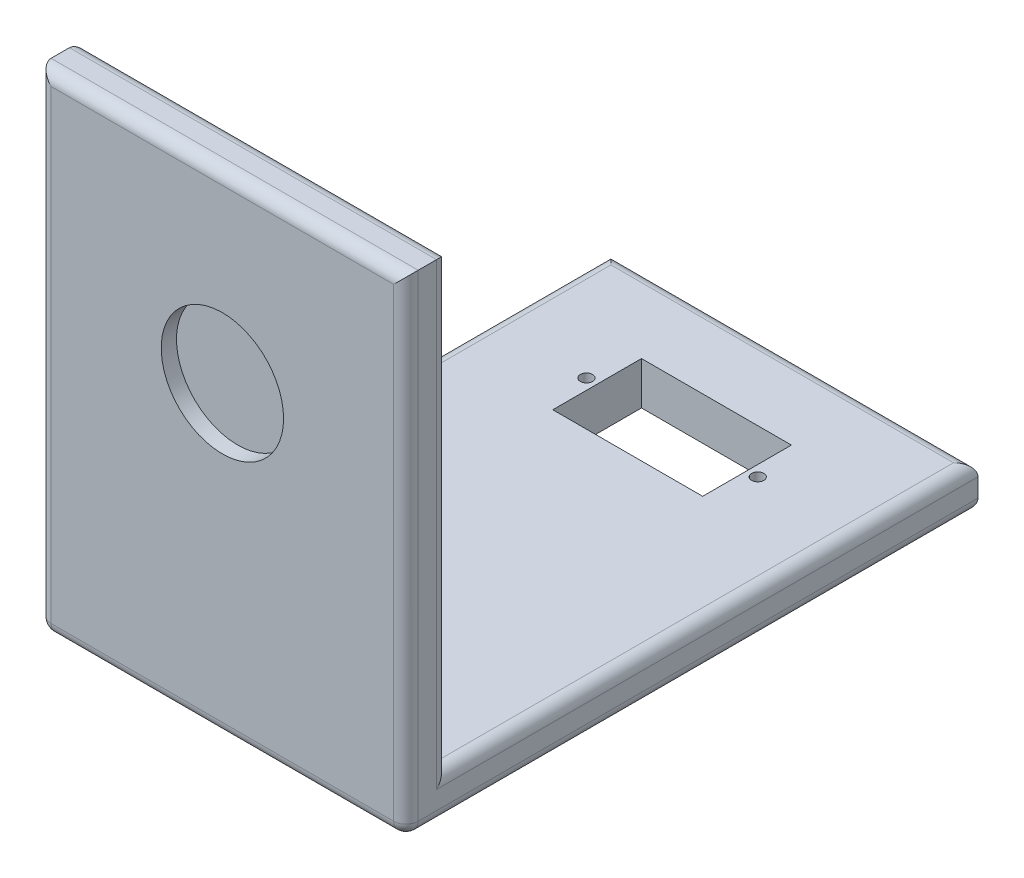
ISO-10303-21;
HEADER;
FILE_DESCRIPTION(('STEP AP214'),'2;1');
FILE_NAME('part.step','',(''),(''),'','','');
FILE_SCHEMA(('AUTOMOTIVE_DESIGN { 1 0 10303 214 1 1 1 1 }'));
ENDSEC;
DATA;
#1=APPLICATION_CONTEXT('core data for automotive mechanical design processes');
#2=APPLICATION_PROTOCOL_DEFINITION('international standard','automotive_design',2000,#1);
#3=PRODUCT_CONTEXT('',#1,'mechanical');
#4=PRODUCT('Part','Part','',(#3));
#5=PRODUCT_RELATED_PRODUCT_CATEGORY('part','',(#4));
#6=PRODUCT_DEFINITION_FORMATION('','',#4);
#7=PRODUCT_DEFINITION_CONTEXT('part definition',#1,'design');
#8=PRODUCT_DEFINITION('design','',#6,#7);
#9=PRODUCT_DEFINITION_SHAPE('','',#8);
#10=(LENGTH_UNIT() NAMED_UNIT(*) SI_UNIT(.MILLI.,.METRE.));
#11=(NAMED_UNIT(*) PLANE_ANGLE_UNIT() SI_UNIT($,.RADIAN.));
#12=(NAMED_UNIT(*) SI_UNIT($,.STERADIAN.) SOLID_ANGLE_UNIT());
#13=UNCERTAINTY_MEASURE_WITH_UNIT(LENGTH_MEASURE(1.E-05),#10,'distance_accuracy_value','');
#14=(GEOMETRIC_REPRESENTATION_CONTEXT(3) GLOBAL_UNCERTAINTY_ASSIGNED_CONTEXT((#13)) GLOBAL_UNIT_ASSIGNED_CONTEXT((#10,
#11,#12)) REPRESENTATION_CONTEXT('',''));
#15=CARTESIAN_POINT('',(0.,0.,0.));
#16=DIRECTION('',(0.,0.,1.));
#17=DIRECTION('',(1.,0.,0.));
#18=AXIS2_PLACEMENT_3D('',#15,#16,#17);
#19=CARTESIAN_POINT('',(30.,-3.5,45.));
#20=DIRECTION('',(1.,0.,0.));
#21=DIRECTION('',(0.,0.,-1.));
#22=AXIS2_PLACEMENT_3D('',#19,#20,#21);
#23=PLANE('',#22);
#24=DIRECTION('',(0.,0.,1.));
#25=VECTOR('',#24,1.);
#26=CARTESIAN_POINT('',(30.,76.5,41.5));
#27=LINE('',#26,#25);
#28=CARTESIAN_POINT('',(30.,76.5,43.5));
#29=VERTEX_POINT('',#28);
#30=CARTESIAN_POINT('',(30.,76.5,46.5));
#31=VERTEX_POINT('',#30);
#32=EDGE_CURVE('E281',#29,#31,#27,.T.);
#33=ORIENTED_EDGE('',*,*,#32,.T.);
#34=DIRECTION('',(0.,1.,0.));
#35=VECTOR('',#34,1.);
#36=CARTESIAN_POINT('',(30.,-3.5,46.5));
#37=LINE('',#36,#35);
#38=CARTESIAN_POINT('',(30.,-1.5,46.5));
#39=VERTEX_POINT('',#38);
#40=EDGE_CURVE('E222',#31,#39,#37,.F.);
#41=ORIENTED_EDGE('',*,*,#40,.T.);
#42=DIRECTION('',(0.,0.,-1.));
#43=VECTOR('',#42,1.);
#44=CARTESIAN_POINT('',(30.,-1.5,45.));
#45=LINE('',#44,#43);
#46=CARTESIAN_POINT('',(30.,-1.5,-45.));
#47=VERTEX_POINT('',#46);
#48=EDGE_CURVE('E220',#39,#47,#45,.T.);
#49=ORIENTED_EDGE('',*,*,#48,.T.);
#50=DIRECTION('',(0.,1.,0.));
#51=VECTOR('',#50,1.);
#52=CARTESIAN_POINT('',(30.,-3.5,-45.));
#53=LINE('',#52,#51);
#54=CARTESIAN_POINT('',(30.,1.5,-45.));
#55=VERTEX_POINT('',#54);
#56=EDGE_CURVE('E164',#47,#55,#53,.T.);
#57=ORIENTED_EDGE('',*,*,#56,.T.);
#58=DIRECTION('',(0.,0.,-1.));
#59=VECTOR('',#58,1.);
#60=CARTESIAN_POINT('',(30.,1.5,41.5));
#61=LINE('',#60,#59);
#62=CARTESIAN_POINT('',(30.,1.5,43.5));
#63=VERTEX_POINT('',#62);
#64=EDGE_CURVE('E216',#55,#63,#61,.F.);
#65=ORIENTED_EDGE('',*,*,#64,.T.);
#66=DIRECTION('',(0.,1.,0.));
#67=VECTOR('',#66,1.);
#68=CARTESIAN_POINT('',(30.,-3.5,43.5));
#69=LINE('',#68,#67);
#70=EDGE_CURVE('E218',#63,#29,#69,.T.);
#71=ORIENTED_EDGE('',*,*,#70,.T.);
#72=EDGE_LOOP('',(#33,#41,#49,#57,#65,#71));
#73=FACE_BOUND('',#72,.T.);
#74=ADVANCED_FACE('F33',(#73),#23,.T.);
#75=CARTESIAN_POINT('',(-30.,-3.5,45.));
#76=DIRECTION('',(-1.,0.,0.));
#77=DIRECTION('',(0.,0.,1.));
#78=AXIS2_PLACEMENT_3D('',#75,#76,#77);
#79=PLANE('',#78);
#80=DIRECTION('',(0.,0.,1.));
#81=VECTOR('',#80,1.);
#82=CARTESIAN_POINT('',(-30.,-1.5,45.));
#83=LINE('',#82,#81);
#84=CARTESIAN_POINT('',(-30.,-1.5,-45.));
#85=VERTEX_POINT('',#84);
#86=CARTESIAN_POINT('',(-30.,-1.5,46.5));
#87=VERTEX_POINT('',#86);
#88=EDGE_CURVE('E238',#85,#87,#83,.T.);
#89=ORIENTED_EDGE('',*,*,#88,.T.);
#90=DIRECTION('',(0.,-1.,0.));
#91=VECTOR('',#90,1.);
#92=CARTESIAN_POINT('',(-30.,76.5,46.5));
#93=LINE('',#92,#91);
#94=CARTESIAN_POINT('',(-30.,76.5,46.5));
#95=VERTEX_POINT('',#94);
#96=EDGE_CURVE('E240',#87,#95,#93,.F.);
#97=ORIENTED_EDGE('',*,*,#96,.T.);
#98=DIRECTION('',(0.,0.,1.));
#99=VECTOR('',#98,1.);
#100=CARTESIAN_POINT('',(-30.,76.5,41.5));
#101=LINE('',#100,#99);
#102=CARTESIAN_POINT('',(-30.,76.5,43.5));
#103=VERTEX_POINT('',#102);
#104=EDGE_CURVE('E329',#103,#95,#101,.T.);
#105=ORIENTED_EDGE('',*,*,#104,.F.);
#106=DIRECTION('',(0.,-1.,0.));
#107=VECTOR('',#106,1.);
#108=CARTESIAN_POINT('',(-30.,-3.5,43.5));
#109=LINE('',#108,#107);
#110=CARTESIAN_POINT('',(-30.,1.5,43.5));
#111=VERTEX_POINT('',#110);
#112=EDGE_CURVE('E235',#103,#111,#109,.T.);
#113=ORIENTED_EDGE('',*,*,#112,.T.);
#114=DIRECTION('',(0.,0.,1.));
#115=VECTOR('',#114,1.);
#116=CARTESIAN_POINT('',(-30.,1.5,-45.));
#117=LINE('',#116,#115);
#118=CARTESIAN_POINT('',(-30.,1.5,-45.));
#119=VERTEX_POINT('',#118);
#120=EDGE_CURVE('E233',#111,#119,#117,.F.);
#121=ORIENTED_EDGE('',*,*,#120,.T.);
#122=DIRECTION('',(0.,1.,0.));
#123=VECTOR('',#122,1.);
#124=CARTESIAN_POINT('',(-30.,-3.5,-45.));
#125=LINE('',#124,#123);
#126=EDGE_CURVE('E195',#85,#119,#125,.T.);
#127=ORIENTED_EDGE('',*,*,#126,.F.);
#128=EDGE_LOOP('',(#89,#97,#105,#113,#121,#127));
#129=FACE_BOUND('',#128,.T.);
#130=ADVANCED_FACE('F333',(#129),#79,.T.);
#131=CARTESIAN_POINT('',(-30.,-3.5,-45.));
#132=DIRECTION('',(0.,0.,-1.));
#133=DIRECTION('',(-1.,0.,0.));
#134=AXIS2_PLACEMENT_3D('',#131,#132,#133);
#135=PLANE('',#134);
#136=ORIENTED_EDGE('',*,*,#56,.F.);
#137=DIRECTION('',(-1.,0.,0.));
#138=VECTOR('',#137,1.);
#139=CARTESIAN_POINT('',(-30.,-1.5,-45.));
#140=LINE('',#139,#138);
#141=EDGE_CURVE('E11',#47,#85,#140,.T.);
#142=ORIENTED_EDGE('',*,*,#141,.T.);
#143=ORIENTED_EDGE('',*,*,#126,.T.);
#144=DIRECTION('',(-1.,0.,0.));
#145=VECTOR('',#144,1.);
#146=CARTESIAN_POINT('',(30.,1.5,-45.));
#147=LINE('',#146,#145);
#148=EDGE_CURVE('E42',#119,#55,#147,.F.);
#149=ORIENTED_EDGE('',*,*,#148,.T.);
#150=EDGE_LOOP('',(#136,#142,#143,#149));
#151=FACE_BOUND('',#150,.T.);
#152=ADVANCED_FACE('F368',(#151),#135,.T.);
#153=CARTESIAN_POINT('',(0.,-3.5,0.));
#154=DIRECTION('',(0.,-1.,0.));
#155=DIRECTION('',(0.,0.,-1.));
#156=AXIS2_PLACEMENT_3D('',#153,#154,#155);
#157=PLANE('',#156);
#158=DIRECTION('',(0.,0.,-1.));
#159=VECTOR('',#158,1.);
#160=CARTESIAN_POINT('',(28.,-3.5,0.));
#161=LINE('',#160,#159);
#162=CARTESIAN_POINT('',(28.,-3.5,-43.));
#163=VERTEX_POINT('',#162);
#164=CARTESIAN_POINT('',(28.,-3.5,46.5));
#165=VERTEX_POINT('',#164);
#166=EDGE_CURVE('E228',#163,#165,#161,.F.);
#167=ORIENTED_EDGE('',*,*,#166,.T.);
#168=DIRECTION('',(1.,0.,0.));
#169=VECTOR('',#168,1.);
#170=CARTESIAN_POINT('',(-30.,-3.5,46.5));
#171=LINE('',#170,#169);
#172=CARTESIAN_POINT('',(-28.,-3.5,46.5));
#173=VERTEX_POINT('',#172);
#174=EDGE_CURVE('E230',#165,#173,#171,.F.);
#175=ORIENTED_EDGE('',*,*,#174,.T.);
#176=DIRECTION('',(0.,0.,1.));
#177=VECTOR('',#176,1.);
#178=CARTESIAN_POINT('',(-28.,-3.5,0.));
#179=LINE('',#178,#177);
#180=CARTESIAN_POINT('',(-28.,-3.5,-43.));
#181=VERTEX_POINT('',#180);
#182=EDGE_CURVE('E224',#173,#181,#179,.F.);
#183=ORIENTED_EDGE('',*,*,#182,.T.);
#184=DIRECTION('',(-1.,0.,0.));
#185=VECTOR('',#184,1.);
#186=CARTESIAN_POINT('',(0.,-3.5,-43.));
#187=LINE('',#186,#185);
#188=EDGE_CURVE('E226',#181,#163,#187,.F.);
#189=ORIENTED_EDGE('',*,*,#188,.T.);
#190=EDGE_LOOP('',(#167,#175,#183,#189));
#191=FACE_BOUND('',#190,.T.);
#192=CARTESIAN_POINT('',(14.,-3.5,-25.));
#193=DIRECTION('',(0.,-1.,0.));
#194=DIRECTION('',(0.,0.,-1.));
#195=AXIS2_PLACEMENT_3D('',#192,#193,#194);
#196=CIRCLE('',#195,1.);
#197=CARTESIAN_POINT('',(14.,-3.5,-26.));
#198=VERTEX_POINT('',#197);
#199=EDGE_CURVE('E335',#198,#198,#196,.F.);
#200=ORIENTED_EDGE('',*,*,#199,.T.);
#201=EDGE_LOOP('',(#200));
#202=FACE_BOUND('',#201,.T.);
#203=CARTESIAN_POINT('',(-14.,-3.5,-25.));
#204=DIRECTION('',(0.,-1.,0.));
#205=DIRECTION('',(0.,0.,-1.));
#206=AXIS2_PLACEMENT_3D('',#203,#204,#205);
#207=CIRCLE('',#206,1.);
#208=CARTESIAN_POINT('',(-14.,-3.5,-26.));
#209=VERTEX_POINT('',#208);
#210=EDGE_CURVE('E348',#209,#209,#207,.F.);
#211=ORIENTED_EDGE('',*,*,#210,.T.);
#212=EDGE_LOOP('',(#211));
#213=FACE_BOUND('',#212,.T.);
#214=DIRECTION('',(0.,0.,-1.));
#215=VECTOR('',#214,1.);
#216=CARTESIAN_POINT('',(12.25,-3.5,-17.75));
#217=LINE('',#216,#215);
#218=CARTESIAN_POINT('',(12.25,-3.5,-17.75));
#219=VERTEX_POINT('',#218);
#220=CARTESIAN_POINT('',(12.25,-3.5,-32.25));
#221=VERTEX_POINT('',#220);
#222=EDGE_CURVE('E169',#219,#221,#217,.T.);
#223=ORIENTED_EDGE('',*,*,#222,.T.);
#224=DIRECTION('',(-1.,0.,0.));
#225=VECTOR('',#224,1.);
#226=CARTESIAN_POINT('',(-12.25,-3.5,-32.25));
#227=LINE('',#226,#225);
#228=CARTESIAN_POINT('',(-12.25,-3.5,-32.25));
#229=VERTEX_POINT('',#228);
#230=EDGE_CURVE('E153',#221,#229,#227,.T.);
#231=ORIENTED_EDGE('',*,*,#230,.T.);
#232=DIRECTION('',(0.,0.,1.));
#233=VECTOR('',#232,1.);
#234=CARTESIAN_POINT('',(-12.25,-3.5,-17.75));
#235=LINE('',#234,#233);
#236=CARTESIAN_POINT('',(-12.25,-3.5,-17.75));
#237=VERTEX_POINT('',#236);
#238=EDGE_CURVE('E181',#229,#237,#235,.T.);
#239=ORIENTED_EDGE('',*,*,#238,.T.);
#240=DIRECTION('',(1.,0.,0.));
#241=VECTOR('',#240,1.);
#242=CARTESIAN_POINT('',(-12.25,-3.5,-17.75));
#243=LINE('',#242,#241);
#244=EDGE_CURVE('E177',#237,#219,#243,.T.);
#245=ORIENTED_EDGE('',*,*,#244,.T.);
#246=EDGE_LOOP('',(#223,#231,#239,#245));
#247=FACE_BOUND('',#246,.T.);
#248=ADVANCED_FACE('F176',(#191,#202,#213,#247),#157,.T.);
#249=CARTESIAN_POINT('',(0.,3.5,0.));
#250=DIRECTION('',(0.,-1.,0.));
#251=DIRECTION('',(0.,0.,-1.));
#252=AXIS2_PLACEMENT_3D('',#249,#250,#251);
#253=PLANE('',#252);
#254=CARTESIAN_POINT('',(14.,3.5,-25.));
#255=DIRECTION('',(0.,1.,0.));
#256=DIRECTION('',(0.,0.,-1.));
#257=AXIS2_PLACEMENT_3D('',#254,#255,#256);
#258=CIRCLE('',#257,1.);
#259=CARTESIAN_POINT('',(14.,3.5,-26.));
#260=VERTEX_POINT('',#259);
#261=EDGE_CURVE('E338',#260,#260,#258,.T.);
#262=ORIENTED_EDGE('',*,*,#261,.F.);
#263=EDGE_LOOP('',(#262));
#264=FACE_BOUND('',#263,.T.);
#265=CARTESIAN_POINT('',(-14.,3.5,-25.));
#266=DIRECTION('',(0.,1.,0.));
#267=DIRECTION('',(0.,0.,1.));
#268=AXIS2_PLACEMENT_3D('',#265,#266,#267);
#269=CIRCLE('',#268,1.);
#270=CARTESIAN_POINT('',(-14.,3.5,-24.));
#271=VERTEX_POINT('',#270);
#272=EDGE_CURVE('E345',#271,#271,#269,.T.);
#273=ORIENTED_EDGE('',*,*,#272,.F.);
#274=EDGE_LOOP('',(#273));
#275=FACE_BOUND('',#274,.T.);
#276=DIRECTION('',(-1.,0.,0.));
#277=VECTOR('',#276,1.);
#278=CARTESIAN_POINT('',(-12.25,3.5,-32.25));
#279=LINE('',#278,#277);
#280=CARTESIAN_POINT('',(12.25,3.5,-32.25));
#281=VERTEX_POINT('',#280);
#282=CARTESIAN_POINT('',(-12.25,3.5,-32.25));
#283=VERTEX_POINT('',#282);
#284=EDGE_CURVE('E179',#281,#283,#279,.T.);
#285=ORIENTED_EDGE('',*,*,#284,.F.);
#286=DIRECTION('',(0.,0.,-1.));
#287=VECTOR('',#286,1.);
#288=CARTESIAN_POINT('',(12.25,3.5,-17.75));
#289=LINE('',#288,#287);
#290=CARTESIAN_POINT('',(12.25,3.5,-17.75));
#291=VERTEX_POINT('',#290);
#292=EDGE_CURVE('E172',#291,#281,#289,.T.);
#293=ORIENTED_EDGE('',*,*,#292,.F.);
#294=DIRECTION('',(1.,0.,0.));
#295=VECTOR('',#294,1.);
#296=CARTESIAN_POINT('',(-12.25,3.5,-17.75));
#297=LINE('',#296,#295);
#298=CARTESIAN_POINT('',(-12.25,3.5,-17.75));
#299=VERTEX_POINT('',#298);
#300=EDGE_CURVE('E173',#299,#291,#297,.T.);
#301=ORIENTED_EDGE('',*,*,#300,.F.);
#302=DIRECTION('',(0.,0.,1.));
#303=VECTOR('',#302,1.);
#304=CARTESIAN_POINT('',(-12.25,3.5,-17.75));
#305=LINE('',#304,#303);
#306=EDGE_CURVE('E186',#283,#299,#305,.T.);
#307=ORIENTED_EDGE('',*,*,#306,.F.);
#308=EDGE_LOOP('',(#285,#293,#301,#307));
#309=FACE_BOUND('',#308,.T.);
#310=DIRECTION('',(1.,0.,0.));
#311=VECTOR('',#310,1.);
#312=CARTESIAN_POINT('',(0.,3.5,41.5));
#313=LINE('',#312,#311);
#314=CARTESIAN_POINT('',(-28.,3.5,41.5));
#315=VERTEX_POINT('',#314);
#316=CARTESIAN_POINT('',(28.,3.5,41.5));
#317=VERTEX_POINT('',#316);
#318=EDGE_CURVE('E198',#315,#317,#313,.T.);
#319=ORIENTED_EDGE('',*,*,#318,.T.);
#320=DIRECTION('',(0.,0.,-1.));
#321=VECTOR('',#320,1.);
#322=CARTESIAN_POINT('',(28.,3.5,-45.));
#323=LINE('',#322,#321);
#324=CARTESIAN_POINT('',(28.,3.5,-43.));
#325=VERTEX_POINT('',#324);
#326=EDGE_CURVE('E50',#317,#325,#323,.T.);
#327=ORIENTED_EDGE('',*,*,#326,.T.);
#328=DIRECTION('',(-1.,0.,0.));
#329=VECTOR('',#328,1.);
#330=CARTESIAN_POINT('',(-30.,3.5,-43.));
#331=LINE('',#330,#329);
#332=CARTESIAN_POINT('',(-28.,3.5,-43.));
#333=VERTEX_POINT('',#332);
#334=EDGE_CURVE('E55',#325,#333,#331,.T.);
#335=ORIENTED_EDGE('',*,*,#334,.T.);
#336=DIRECTION('',(0.,0.,1.));
#337=VECTOR('',#336,1.);
#338=CARTESIAN_POINT('',(-28.,3.5,41.5));
#339=LINE('',#338,#337);
#340=EDGE_CURVE('E249',#333,#315,#339,.T.);
#341=ORIENTED_EDGE('',*,*,#340,.T.);
#342=EDGE_LOOP('',(#319,#327,#335,#341));
#343=FACE_BOUND('',#342,.T.);
#344=ADVANCED_FACE('F312',(#264,#275,#309,#343),#253,.F.);
#345=CARTESIAN_POINT('',(12.25,-3.501,-17.75));
#346=DIRECTION('',(1.,0.,0.));
#347=DIRECTION('',(0.,0.,-1.));
#348=AXIS2_PLACEMENT_3D('',#345,#346,#347);
#349=PLANE('',#348);
#350=DIRECTION('',(0.,1.,0.));
#351=VECTOR('',#350,1.);
#352=CARTESIAN_POINT('',(12.25,-3.501,-17.75));
#353=LINE('',#352,#351);
#354=EDGE_CURVE('E165',#219,#291,#353,.T.);
#355=ORIENTED_EDGE('',*,*,#354,.T.);
#356=ORIENTED_EDGE('',*,*,#292,.T.);
#357=DIRECTION('',(0.,1.,0.));
#358=VECTOR('',#357,1.);
#359=CARTESIAN_POINT('',(12.25,-3.501,-32.25));
#360=LINE('',#359,#358);
#361=EDGE_CURVE('E157',#221,#281,#360,.T.);
#362=ORIENTED_EDGE('',*,*,#361,.F.);
#363=ORIENTED_EDGE('',*,*,#222,.F.);
#364=EDGE_LOOP('',(#355,#356,#362,#363));
#365=FACE_BOUND('',#364,.T.);
#366=ADVANCED_FACE('F168',(#365),#349,.F.);
#367=CARTESIAN_POINT('',(-12.25,-3.501,-17.75));
#368=DIRECTION('',(0.,0.,1.));
#369=DIRECTION('',(1.,0.,0.));
#370=AXIS2_PLACEMENT_3D('',#367,#368,#369);
#371=PLANE('',#370);
#372=DIRECTION('',(0.,1.,0.));
#373=VECTOR('',#372,1.);
#374=CARTESIAN_POINT('',(-12.25,-3.501,-17.75));
#375=LINE('',#374,#373);
#376=EDGE_CURVE('E192',#237,#299,#375,.T.);
#377=ORIENTED_EDGE('',*,*,#376,.T.);
#378=ORIENTED_EDGE('',*,*,#300,.T.);
#379=ORIENTED_EDGE('',*,*,#354,.F.);
#380=ORIENTED_EDGE('',*,*,#244,.F.);
#381=EDGE_LOOP('',(#377,#378,#379,#380));
#382=FACE_BOUND('',#381,.T.);
#383=ADVANCED_FACE('F358',(#382),#371,.F.);
#384=CARTESIAN_POINT('',(-12.25,-3.501,-17.75));
#385=DIRECTION('',(-1.,0.,0.));
#386=DIRECTION('',(0.,0.,1.));
#387=AXIS2_PLACEMENT_3D('',#384,#385,#386);
#388=PLANE('',#387);
#389=DIRECTION('',(0.,1.,0.));
#390=VECTOR('',#389,1.);
#391=CARTESIAN_POINT('',(-12.25,-3.501,-32.25));
#392=LINE('',#391,#390);
#393=EDGE_CURVE('E159',#229,#283,#392,.T.);
#394=ORIENTED_EDGE('',*,*,#393,.T.);
#395=ORIENTED_EDGE('',*,*,#306,.T.);
#396=ORIENTED_EDGE('',*,*,#376,.F.);
#397=ORIENTED_EDGE('',*,*,#238,.F.);
#398=EDGE_LOOP('',(#394,#395,#396,#397));
#399=FACE_BOUND('',#398,.T.);
#400=ADVANCED_FACE('F354',(#399),#388,.F.);
#401=CARTESIAN_POINT('',(-12.25,-3.501,-32.25));
#402=DIRECTION('',(0.,0.,-1.));
#403=DIRECTION('',(-1.,0.,0.));
#404=AXIS2_PLACEMENT_3D('',#401,#402,#403);
#405=PLANE('',#404);
#406=ORIENTED_EDGE('',*,*,#361,.T.);
#407=ORIENTED_EDGE('',*,*,#284,.T.);
#408=ORIENTED_EDGE('',*,*,#393,.F.);
#409=ORIENTED_EDGE('',*,*,#230,.F.);
#410=EDGE_LOOP('',(#406,#407,#408,#409));
#411=FACE_BOUND('',#410,.T.);
#412=ADVANCED_FACE('F155',(#411),#405,.F.);
#413=CARTESIAN_POINT('',(-14.,-3.501,-25.));
#414=DIRECTION('',(0.,1.,0.));
#415=DIRECTION('',(0.,0.,1.));
#416=AXIS2_PLACEMENT_3D('',#413,#414,#415);
#417=CYLINDRICAL_SURFACE('',#416,1.);
#418=ORIENTED_EDGE('',*,*,#210,.F.);
#419=EDGE_LOOP('',(#418));
#420=FACE_BOUND('',#419,.T.);
#421=ORIENTED_EDGE('',*,*,#272,.T.);
#422=EDGE_LOOP('',(#421));
#423=FACE_BOUND('',#422,.T.);
#424=ADVANCED_FACE('F497',(#420,#423),#417,.F.);
#425=CARTESIAN_POINT('',(14.,-3.501,-25.));
#426=DIRECTION('',(0.,1.,0.));
#427=DIRECTION('',(0.,0.,1.));
#428=AXIS2_PLACEMENT_3D('',#425,#426,#427);
#429=CYLINDRICAL_SURFACE('',#428,1.);
#430=ORIENTED_EDGE('',*,*,#199,.F.);
#431=EDGE_LOOP('',(#430));
#432=FACE_BOUND('',#431,.T.);
#433=ORIENTED_EDGE('',*,*,#261,.T.);
#434=EDGE_LOOP('',(#433));
#435=FACE_BOUND('',#434,.T.);
#436=ADVANCED_FACE('F490',(#432,#435),#429,.F.);
#437=CARTESIAN_POINT('',(0.,0.,41.5));
#438=DIRECTION('',(0.,0.,-1.));
#439=DIRECTION('',(-1.,0.,0.));
#440=AXIS2_PLACEMENT_3D('',#437,#438,#439);
#441=PLANE('',#440);
#442=ORIENTED_EDGE('',*,*,#318,.F.);
#443=DIRECTION('',(0.,-1.,0.));
#444=VECTOR('',#443,1.);
#445=CARTESIAN_POINT('',(-28.,0.,41.5));
#446=LINE('',#445,#444);
#447=CARTESIAN_POINT('',(-28.,74.5,41.5));
#448=VERTEX_POINT('',#447);
#449=EDGE_CURVE('E246',#315,#448,#446,.F.);
#450=ORIENTED_EDGE('',*,*,#449,.T.);
#451=DIRECTION('',(-1.,0.,0.));
#452=VECTOR('',#451,1.);
#453=CARTESIAN_POINT('',(0.,74.5,41.5));
#454=LINE('',#453,#452);
#455=CARTESIAN_POINT('',(28.,74.5,41.5));
#456=VERTEX_POINT('',#455);
#457=EDGE_CURVE('E242',#448,#456,#454,.F.);
#458=ORIENTED_EDGE('',*,*,#457,.T.);
#459=DIRECTION('',(0.,1.,0.));
#460=VECTOR('',#459,1.);
#461=CARTESIAN_POINT('',(28.,0.,41.5));
#462=LINE('',#461,#460);
#463=EDGE_CURVE('E244',#456,#317,#462,.F.);
#464=ORIENTED_EDGE('',*,*,#463,.T.);
#465=EDGE_LOOP('',(#442,#450,#458,#464));
#466=FACE_BOUND('',#465,.T.);
#467=ADVANCED_FACE('F315',(#466),#441,.T.);
#468=CARTESIAN_POINT('',(-30.,76.5,41.5));
#469=DIRECTION('',(0.,1.,0.));
#470=DIRECTION('',(0.,0.,1.));
#471=AXIS2_PLACEMENT_3D('',#468,#469,#470);
#472=PLANE('',#471);
#473=ORIENTED_EDGE('',*,*,#104,.T.);
#474=DIRECTION('',(-1.,0.,0.));
#475=VECTOR('',#474,1.);
#476=CARTESIAN_POINT('',(30.,76.5,46.5));
#477=LINE('',#476,#475);
#478=EDGE_CURVE('E213',#95,#31,#477,.F.);
#479=ORIENTED_EDGE('',*,*,#478,.T.);
#480=ORIENTED_EDGE('',*,*,#32,.F.);
#481=DIRECTION('',(-1.,0.,0.));
#482=VECTOR('',#481,1.);
#483=CARTESIAN_POINT('',(-30.,76.5,43.5));
#484=LINE('',#483,#482);
#485=EDGE_CURVE('E211',#29,#103,#484,.T.);
#486=ORIENTED_EDGE('',*,*,#485,.T.);
#487=EDGE_LOOP('',(#473,#479,#480,#486));
#488=FACE_BOUND('',#487,.T.);
#489=ADVANCED_FACE('F328',(#488),#472,.T.);
#490=CARTESIAN_POINT('',(0.,0.,48.5));
#491=DIRECTION('',(0.,0.,-1.));
#492=DIRECTION('',(-1.,0.,0.));
#493=AXIS2_PLACEMENT_3D('',#490,#491,#492);
#494=PLANE('',#493);
#495=CARTESIAN_POINT('',(0.,46.5,48.5));
#496=DIRECTION('',(0.,0.,1.));
#497=DIRECTION('',(1.,0.,0.));
#498=AXIS2_PLACEMENT_3D('',#495,#496,#497);
#499=CIRCLE('',#498,10.);
#500=CARTESIAN_POINT('',(10.,46.5,48.5));
#501=VERTEX_POINT('',#500);
#502=EDGE_CURVE('E342',#501,#501,#499,.T.);
#503=ORIENTED_EDGE('',*,*,#502,.F.);
#504=EDGE_LOOP('',(#503));
#505=FACE_BOUND('',#504,.T.);
#506=DIRECTION('',(0.,1.,0.));
#507=VECTOR('',#506,1.);
#508=CARTESIAN_POINT('',(28.,76.5,48.5));
#509=LINE('',#508,#507);
#510=CARTESIAN_POINT('',(28.,-1.5,48.5));
#511=VERTEX_POINT('',#510);
#512=CARTESIAN_POINT('',(28.,74.5,48.5));
#513=VERTEX_POINT('',#512);
#514=EDGE_CURVE('E206',#511,#513,#509,.T.);
#515=ORIENTED_EDGE('',*,*,#514,.T.);
#516=DIRECTION('',(-1.,0.,0.));
#517=VECTOR('',#516,1.);
#518=CARTESIAN_POINT('',(-30.,74.5,48.5));
#519=LINE('',#518,#517);
#520=CARTESIAN_POINT('',(-28.,74.5,48.5));
#521=VERTEX_POINT('',#520);
#522=EDGE_CURVE('E208',#513,#521,#519,.T.);
#523=ORIENTED_EDGE('',*,*,#522,.T.);
#524=DIRECTION('',(0.,-1.,0.));
#525=VECTOR('',#524,1.);
#526=CARTESIAN_POINT('',(-28.,-3.5,48.5));
#527=LINE('',#526,#525);
#528=CARTESIAN_POINT('',(-28.,-1.5,48.5));
#529=VERTEX_POINT('',#528);
#530=EDGE_CURVE('E202',#521,#529,#527,.T.);
#531=ORIENTED_EDGE('',*,*,#530,.T.);
#532=DIRECTION('',(1.,0.,0.));
#533=VECTOR('',#532,1.);
#534=CARTESIAN_POINT('',(30.,-1.5,48.5));
#535=LINE('',#534,#533);
#536=EDGE_CURVE('E204',#529,#511,#535,.T.);
#537=ORIENTED_EDGE('',*,*,#536,.T.);
#538=EDGE_LOOP('',(#515,#523,#531,#537));
#539=FACE_BOUND('',#538,.T.);
#540=ADVANCED_FACE('F417',(#505,#539),#494,.F.);
#541=CARTESIAN_POINT('',(-30.,-1.5,-43.));
#542=DIRECTION('',(-1.,0.,0.));
#543=DIRECTION('',(0.,0.,1.));
#544=AXIS2_PLACEMENT_3D('',#541,#542,#543);
#545=CYLINDRICAL_SURFACE('',#544,2.);
#546=CARTESIAN_POINT('',(-28.,-1.5,-43.));
#547=DIRECTION('',(-0.707106781186547,0.,0.707106781186547));
#548=DIRECTION('',(0.707106781186547,0.,0.707106781186547));
#549=AXIS2_PLACEMENT_3D('',#546,#547,#548);
#550=ELLIPSE('',#549,2.82842712474619,2.);
#551=EDGE_CURVE('E275',#85,#181,#550,.T.);
#552=ORIENTED_EDGE('',*,*,#551,.F.);
#553=ORIENTED_EDGE('',*,*,#141,.F.);
#554=CARTESIAN_POINT('',(28.,-1.5,-43.));
#555=DIRECTION('',(-0.707106781186547,0.,-0.707106781186547));
#556=DIRECTION('',(-0.707106781186547,0.,0.707106781186547));
#557=AXIS2_PLACEMENT_3D('',#554,#555,#556);
#558=ELLIPSE('',#557,2.82842712474619,2.);
#559=EDGE_CURVE('E278',#163,#47,#558,.F.);
#560=ORIENTED_EDGE('',*,*,#559,.F.);
#561=ORIENTED_EDGE('',*,*,#188,.F.);
#562=EDGE_LOOP('',(#552,#553,#560,#561));
#563=FACE_BOUND('',#562,.T.);
#564=ADVANCED_FACE('F413',(#563),#545,.T.);
#565=CARTESIAN_POINT('',(28.,-1.5,45.));
#566=DIRECTION('',(0.,0.,-1.));
#567=DIRECTION('',(-1.,0.,0.));
#568=AXIS2_PLACEMENT_3D('',#565,#566,#567);
#569=CYLINDRICAL_SURFACE('',#568,2.);
#570=ORIENTED_EDGE('',*,*,#559,.T.);
#571=ORIENTED_EDGE('',*,*,#48,.F.);
#572=CARTESIAN_POINT('',(28.,-1.5,46.5));
#573=DIRECTION('',(0.,0.,1.));
#574=DIRECTION('',(1.,0.,0.));
#575=AXIS2_PLACEMENT_3D('',#572,#573,#574);
#576=CIRCLE('',#575,2.);
#577=EDGE_CURVE('E272',#165,#39,#576,.T.);
#578=ORIENTED_EDGE('',*,*,#577,.F.);
#579=ORIENTED_EDGE('',*,*,#166,.F.);
#580=EDGE_LOOP('',(#570,#571,#578,#579));
#581=FACE_BOUND('',#580,.T.);
#582=ADVANCED_FACE('F409',(#581),#569,.T.);
#583=CARTESIAN_POINT('',(0.,-1.5,46.5));
#584=DIRECTION('',(-1.,0.,0.));
#585=DIRECTION('',(0.,0.,1.));
#586=AXIS2_PLACEMENT_3D('',#583,#584,#585);
#587=CYLINDRICAL_SURFACE('',#586,2.);
#588=CARTESIAN_POINT('',(-28.,-1.5,46.5));
#589=DIRECTION('',(-1.,0.,0.));
#590=DIRECTION('',(0.,0.,1.));
#591=AXIS2_PLACEMENT_3D('',#588,#589,#590);
#592=CIRCLE('',#591,2.);
#593=EDGE_CURVE('E266',#173,#529,#592,.T.);
#594=ORIENTED_EDGE('',*,*,#593,.F.);
#595=ORIENTED_EDGE('',*,*,#174,.F.);
#596=CARTESIAN_POINT('',(28.,-1.5,46.5));
#597=DIRECTION('',(1.,0.,0.));
#598=DIRECTION('',(0.,0.,-1.));
#599=AXIS2_PLACEMENT_3D('',#596,#597,#598);
#600=CIRCLE('',#599,2.);
#601=EDGE_CURVE('E269',#511,#165,#600,.T.);
#602=ORIENTED_EDGE('',*,*,#601,.F.);
#603=ORIENTED_EDGE('',*,*,#536,.F.);
#604=EDGE_LOOP('',(#594,#595,#602,#603));
#605=FACE_BOUND('',#604,.T.);
#606=ADVANCED_FACE('F405',(#605),#587,.T.);
#607=CARTESIAN_POINT('',(-28.,-1.5,45.));
#608=DIRECTION('',(0.,0.,1.));
#609=DIRECTION('',(1.,0.,0.));
#610=AXIS2_PLACEMENT_3D('',#607,#608,#609);
#611=CYLINDRICAL_SURFACE('',#610,2.);
#612=ORIENTED_EDGE('',*,*,#551,.T.);
#613=ORIENTED_EDGE('',*,*,#182,.F.);
#614=CARTESIAN_POINT('',(-28.,-1.5,46.5));
#615=DIRECTION('',(0.,0.,1.));
#616=DIRECTION('',(1.,0.,0.));
#617=AXIS2_PLACEMENT_3D('',#614,#615,#616);
#618=CIRCLE('',#617,2.);
#619=EDGE_CURVE('E264',#87,#173,#618,.T.);
#620=ORIENTED_EDGE('',*,*,#619,.F.);
#621=ORIENTED_EDGE('',*,*,#88,.F.);
#622=EDGE_LOOP('',(#612,#613,#620,#621));
#623=FACE_BOUND('',#622,.T.);
#624=ADVANCED_FACE('F401',(#623),#611,.T.);
#625=CARTESIAN_POINT('',(28.,-1.5,46.5));
#626=DIRECTION('',(0.,0.,1.));
#627=DIRECTION('',(1.,0.,0.));
#628=AXIS2_PLACEMENT_3D('',#625,#626,#627);
#629=SPHERICAL_SURFACE('',#628,2.);
#630=ORIENTED_EDGE('',*,*,#601,.T.);
#631=ORIENTED_EDGE('',*,*,#577,.T.);
#632=CARTESIAN_POINT('',(28.,-1.5,46.5));
#633=DIRECTION('',(0.,-1.,0.));
#634=DIRECTION('',(0.,0.,-1.));
#635=AXIS2_PLACEMENT_3D('',#632,#633,#634);
#636=CIRCLE('',#635,2.);
#637=EDGE_CURVE('E261',#511,#39,#636,.F.);
#638=ORIENTED_EDGE('',*,*,#637,.F.);
#639=EDGE_LOOP('',(#630,#631,#638));
#640=FACE_BOUND('',#639,.T.);
#641=ADVANCED_FACE('F397',(#640),#629,.T.);
#642=CARTESIAN_POINT('',(-28.,-1.5,46.5));
#643=DIRECTION('',(0.,0.,1.));
#644=DIRECTION('',(1.,0.,0.));
#645=AXIS2_PLACEMENT_3D('',#642,#643,#644);
#646=SPHERICAL_SURFACE('',#645,2.);
#647=ORIENTED_EDGE('',*,*,#619,.T.);
#648=ORIENTED_EDGE('',*,*,#593,.T.);
#649=CARTESIAN_POINT('',(-28.,-1.5,46.5));
#650=DIRECTION('',(0.,-1.,0.));
#651=DIRECTION('',(0.,0.,-1.));
#652=AXIS2_PLACEMENT_3D('',#649,#650,#651);
#653=CIRCLE('',#652,2.);
#654=EDGE_CURVE('E258',#87,#529,#653,.F.);
#655=ORIENTED_EDGE('',*,*,#654,.F.);
#656=EDGE_LOOP('',(#647,#648,#655));
#657=FACE_BOUND('',#656,.T.);
#658=ADVANCED_FACE('F393',(#657),#646,.T.);
#659=CARTESIAN_POINT('',(28.,0.,46.5));
#660=DIRECTION('',(0.,-1.,0.));
#661=DIRECTION('',(0.,0.,-1.));
#662=AXIS2_PLACEMENT_3D('',#659,#660,#661);
#663=CYLINDRICAL_SURFACE('',#662,2.);
#664=ORIENTED_EDGE('',*,*,#637,.T.);
#665=ORIENTED_EDGE('',*,*,#40,.F.);
#666=CARTESIAN_POINT('',(28.,74.5,46.5));
#667=DIRECTION('',(0.707106781186547,-0.707106781186547,0.));
#668=DIRECTION('',(-0.707106781186547,-0.707106781186547,0.));
#669=AXIS2_PLACEMENT_3D('',#666,#667,#668);
#670=ELLIPSE('',#669,2.82842712474619,2.);
#671=EDGE_CURVE('E256',#513,#31,#670,.F.);
#672=ORIENTED_EDGE('',*,*,#671,.F.);
#673=ORIENTED_EDGE('',*,*,#514,.F.);
#674=EDGE_LOOP('',(#664,#665,#672,#673));
#675=FACE_BOUND('',#674,.T.);
#676=ADVANCED_FACE('F389',(#675),#663,.T.);
#677=CARTESIAN_POINT('',(-28.,0.,46.5));
#678=DIRECTION('',(0.,1.,0.));
#679=DIRECTION('',(0.,0.,1.));
#680=AXIS2_PLACEMENT_3D('',#677,#678,#679);
#681=CYLINDRICAL_SURFACE('',#680,2.);
#682=ORIENTED_EDGE('',*,*,#654,.T.);
#683=ORIENTED_EDGE('',*,*,#530,.F.);
#684=CARTESIAN_POINT('',(-28.,74.5,46.5));
#685=DIRECTION('',(0.707106781186547,0.707106781186547,0.));
#686=DIRECTION('',(-0.707106781186547,0.707106781186547,0.));
#687=AXIS2_PLACEMENT_3D('',#684,#685,#686);
#688=ELLIPSE('',#687,2.82842712474619,2.);
#689=EDGE_CURVE('E254',#95,#521,#688,.T.);
#690=ORIENTED_EDGE('',*,*,#689,.F.);
#691=ORIENTED_EDGE('',*,*,#96,.F.);
#692=EDGE_LOOP('',(#682,#683,#690,#691));
#693=FACE_BOUND('',#692,.T.);
#694=ADVANCED_FACE('F385',(#693),#681,.T.);
#695=CARTESIAN_POINT('',(0.,74.5,46.5));
#696=DIRECTION('',(1.,0.,0.));
#697=DIRECTION('',(0.,0.,-1.));
#698=AXIS2_PLACEMENT_3D('',#695,#696,#697);
#699=CYLINDRICAL_SURFACE('',#698,2.);
#700=ORIENTED_EDGE('',*,*,#671,.T.);
#701=ORIENTED_EDGE('',*,*,#478,.F.);
#702=ORIENTED_EDGE('',*,*,#689,.T.);
#703=ORIENTED_EDGE('',*,*,#522,.F.);
#704=EDGE_LOOP('',(#700,#701,#702,#703));
#705=FACE_BOUND('',#704,.T.);
#706=ADVANCED_FACE('F382',(#705),#699,.T.);
#707=CARTESIAN_POINT('',(28.,1.5,0.));
#708=DIRECTION('',(0.,0.,1.));
#709=DIRECTION('',(1.,0.,0.));
#710=AXIS2_PLACEMENT_3D('',#707,#708,#709);
#711=CYLINDRICAL_SURFACE('',#710,2.);
#712=CARTESIAN_POINT('',(28.,1.5,-43.));
#713=DIRECTION('',(0.707106781186547,0.,0.707106781186547));
#714=DIRECTION('',(0.707106781186547,0.,-0.707106781186547));
#715=AXIS2_PLACEMENT_3D('',#712,#713,#714);
#716=ELLIPSE('',#715,2.82842712474619,2.);
#717=EDGE_CURVE('E292',#325,#55,#716,.F.);
#718=ORIENTED_EDGE('',*,*,#717,.F.);
#719=ORIENTED_EDGE('',*,*,#326,.F.);
#720=CARTESIAN_POINT('',(28.,1.5,43.5));
#721=DIRECTION('',(0.,0.707106781186547,0.707106781186547));
#722=DIRECTION('',(0.,0.707106781186547,-0.707106781186547));
#723=AXIS2_PLACEMENT_3D('',#720,#721,#722);
#724=ELLIPSE('',#723,2.82842712474619,2.);
#725=EDGE_CURVE('E37',#63,#317,#724,.T.);
#726=ORIENTED_EDGE('',*,*,#725,.F.);
#727=ORIENTED_EDGE('',*,*,#64,.F.);
#728=EDGE_LOOP('',(#718,#719,#726,#727));
#729=FACE_BOUND('',#728,.T.);
#730=ADVANCED_FACE('F35',(#729),#711,.T.);
#731=CARTESIAN_POINT('',(28.,-3.5,43.5));
#732=DIRECTION('',(0.,1.,0.));
#733=DIRECTION('',(0.,0.,1.));
#734=AXIS2_PLACEMENT_3D('',#731,#732,#733);
#735=CYLINDRICAL_SURFACE('',#734,2.);
#736=ORIENTED_EDGE('',*,*,#725,.T.);
#737=ORIENTED_EDGE('',*,*,#463,.F.);
#738=CARTESIAN_POINT('',(28.,74.5,43.5));
#739=DIRECTION('',(-0.707106781186547,0.707106781186547,0.));
#740=DIRECTION('',(-0.707106781186547,-0.707106781186547,0.));
#741=AXIS2_PLACEMENT_3D('',#738,#739,#740);
#742=ELLIPSE('',#741,2.82842712474619,2.);
#743=EDGE_CURVE('E290',#29,#456,#742,.T.);
#744=ORIENTED_EDGE('',*,*,#743,.F.);
#745=ORIENTED_EDGE('',*,*,#70,.F.);
#746=EDGE_LOOP('',(#736,#737,#744,#745));
#747=FACE_BOUND('',#746,.T.);
#748=ADVANCED_FACE('F301',(#747),#735,.T.);
#749=CARTESIAN_POINT('',(0.,1.5,-43.));
#750=DIRECTION('',(1.,0.,0.));
#751=DIRECTION('',(0.,0.,-1.));
#752=AXIS2_PLACEMENT_3D('',#749,#750,#751);
#753=CYLINDRICAL_SURFACE('',#752,2.);
#754=ORIENTED_EDGE('',*,*,#717,.T.);
#755=ORIENTED_EDGE('',*,*,#148,.F.);
#756=CARTESIAN_POINT('',(-28.,1.5,-43.));
#757=DIRECTION('',(0.707106781186547,0.,-0.707106781186547));
#758=DIRECTION('',(-0.707106781186547,0.,-0.707106781186547));
#759=AXIS2_PLACEMENT_3D('',#756,#757,#758);
#760=ELLIPSE('',#759,2.82842712474619,2.);
#761=EDGE_CURVE('E287',#333,#119,#760,.F.);
#762=ORIENTED_EDGE('',*,*,#761,.F.);
#763=ORIENTED_EDGE('',*,*,#334,.F.);
#764=EDGE_LOOP('',(#754,#755,#762,#763));
#765=FACE_BOUND('',#764,.T.);
#766=ADVANCED_FACE('F305',(#765),#753,.T.);
#767=CARTESIAN_POINT('',(-30.,74.5,43.5));
#768=DIRECTION('',(-1.,0.,0.));
#769=DIRECTION('',(0.,0.,1.));
#770=AXIS2_PLACEMENT_3D('',#767,#768,#769);
#771=CYLINDRICAL_SURFACE('',#770,2.);
#772=ORIENTED_EDGE('',*,*,#743,.T.);
#773=ORIENTED_EDGE('',*,*,#457,.F.);
#774=CARTESIAN_POINT('',(-28.,74.5,43.5));
#775=DIRECTION('',(-0.707106781186547,-0.707106781186547,0.));
#776=DIRECTION('',(-0.707106781186547,0.707106781186547,0.));
#777=AXIS2_PLACEMENT_3D('',#774,#775,#776);
#778=ELLIPSE('',#777,2.82842712474619,2.);
#779=EDGE_CURVE('E284',#103,#448,#778,.T.);
#780=ORIENTED_EDGE('',*,*,#779,.F.);
#781=ORIENTED_EDGE('',*,*,#485,.F.);
#782=EDGE_LOOP('',(#772,#773,#780,#781));
#783=FACE_BOUND('',#782,.T.);
#784=ADVANCED_FACE('F323',(#783),#771,.T.);
#785=CARTESIAN_POINT('',(-28.,1.5,0.));
#786=DIRECTION('',(0.,0.,-1.));
#787=DIRECTION('',(-1.,0.,0.));
#788=AXIS2_PLACEMENT_3D('',#785,#786,#787);
#789=CYLINDRICAL_SURFACE('',#788,2.);
#790=ORIENTED_EDGE('',*,*,#761,.T.);
#791=ORIENTED_EDGE('',*,*,#120,.F.);
#792=CARTESIAN_POINT('',(-28.,1.5,43.5));
#793=DIRECTION('',(0.,-0.707106781186547,-0.707106781186547));
#794=DIRECTION('',(0.,-0.707106781186547,0.707106781186547));
#795=AXIS2_PLACEMENT_3D('',#792,#793,#794);
#796=ELLIPSE('',#795,2.82842712474619,2.);
#797=EDGE_CURVE('E282',#315,#111,#796,.F.);
#798=ORIENTED_EDGE('',*,*,#797,.F.);
#799=ORIENTED_EDGE('',*,*,#340,.F.);
#800=EDGE_LOOP('',(#790,#791,#798,#799));
#801=FACE_BOUND('',#800,.T.);
#802=ADVANCED_FACE('F310',(#801),#789,.T.);
#803=CARTESIAN_POINT('',(-28.,-3.5,43.5));
#804=DIRECTION('',(0.,-1.,0.));
#805=DIRECTION('',(0.,0.,-1.));
#806=AXIS2_PLACEMENT_3D('',#803,#804,#805);
#807=CYLINDRICAL_SURFACE('',#806,2.);
#808=ORIENTED_EDGE('',*,*,#779,.T.);
#809=ORIENTED_EDGE('',*,*,#449,.F.);
#810=ORIENTED_EDGE('',*,*,#797,.T.);
#811=ORIENTED_EDGE('',*,*,#112,.F.);
#812=EDGE_LOOP('',(#808,#809,#810,#811));
#813=FACE_BOUND('',#812,.T.);
#814=ADVANCED_FACE('F317',(#813),#807,.T.);
#815=CARTESIAN_POINT('',(0.,46.5,46.));
#816=DIRECTION('',(0.,0.,1.));
#817=DIRECTION('',(1.,0.,0.));
#818=AXIS2_PLACEMENT_3D('',#815,#816,#817);
#819=CYLINDRICAL_SURFACE('',#818,10.);
#820=CARTESIAN_POINT('',(0.,46.5,46.));
#821=DIRECTION('',(0.,0.,1.));
#822=DIRECTION('',(1.,0.,0.));
#823=AXIS2_PLACEMENT_3D('',#820,#821,#822);
#824=CIRCLE('',#823,10.);
#825=CARTESIAN_POINT('',(10.,46.5,46.));
#826=VERTEX_POINT('',#825);
#827=EDGE_CURVE('E285',#826,#826,#824,.T.);
#828=ORIENTED_EDGE('',*,*,#827,.F.);
#829=EDGE_LOOP('',(#828));
#830=FACE_BOUND('',#829,.T.);
#831=ORIENTED_EDGE('',*,*,#502,.T.);
#832=EDGE_LOOP('',(#831));
#833=FACE_BOUND('',#832,.T.);
#834=ADVANCED_FACE('F421',(#830,#833),#819,.F.);
#835=CARTESIAN_POINT('',(0.,46.5,46.));
#836=DIRECTION('',(0.,0.,1.));
#837=DIRECTION('',(1.,0.,0.));
#838=AXIS2_PLACEMENT_3D('',#835,#836,#837);
#839=PLANE('',#838);
#840=ORIENTED_EDGE('',*,*,#827,.T.);
#841=EDGE_LOOP('',(#840));
#842=FACE_BOUND('',#841,.T.);
#843=ADVANCED_FACE('F624',(#842),#839,.T.);
#844=CLOSED_SHELL('',(#74,#130,#152,#248,#344,#366,#383,#400,#412,#424,#436,#467,#489,#540,#564,
#582,#606,#624,#641,#658,#676,#694,#706,#730,#748,#766,#784,#802,#814,#834,#843));
#845=MANIFOLD_SOLID_BREP('B2',#844);
#846=ADVANCED_BREP_SHAPE_REPRESENTATION('',(#18,#845),#14);
#847=SHAPE_DEFINITION_REPRESENTATION(#9,#846);
ENDSEC;
END-ISO-10303-21;
